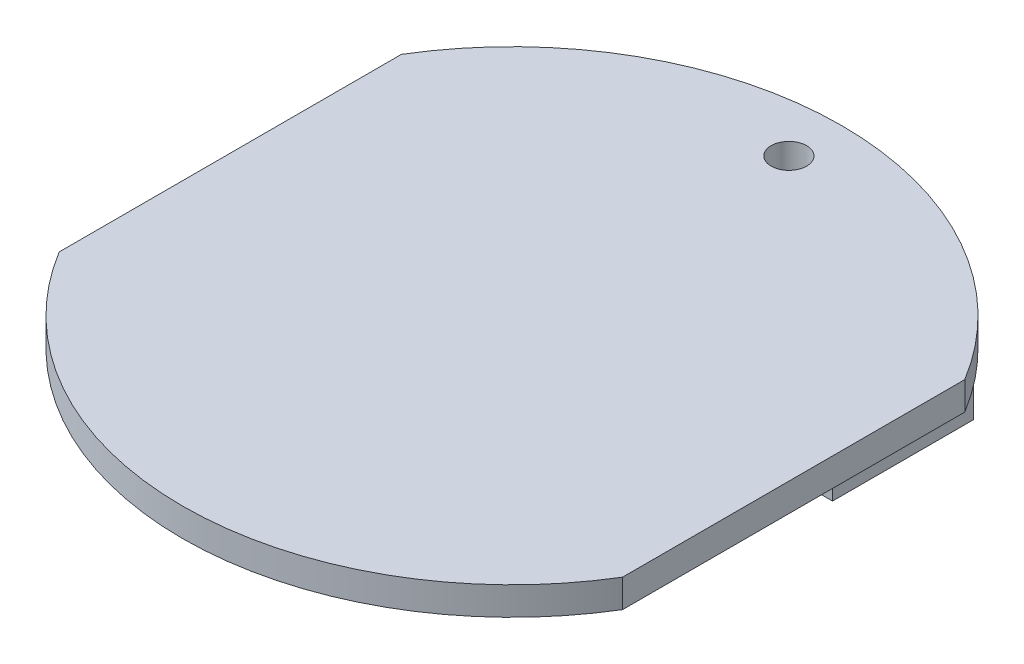
ISO-10303-21;
HEADER;
FILE_DESCRIPTION(('STEP AP214'),'2;1');
FILE_NAME('part.step','',(''),(''),'','','');
FILE_SCHEMA(('AUTOMOTIVE_DESIGN { 1 0 10303 214 1 1 1 1 }'));
ENDSEC;
DATA;
#1=APPLICATION_CONTEXT('core data for automotive mechanical design processes');
#2=APPLICATION_PROTOCOL_DEFINITION('international standard','automotive_design',2000,#1);
#3=PRODUCT_CONTEXT('',#1,'mechanical');
#4=PRODUCT('Part','Part','',(#3));
#5=PRODUCT_RELATED_PRODUCT_CATEGORY('part','',(#4));
#6=PRODUCT_DEFINITION_FORMATION('','',#4);
#7=PRODUCT_DEFINITION_CONTEXT('part definition',#1,'design');
#8=PRODUCT_DEFINITION('design','',#6,#7);
#9=PRODUCT_DEFINITION_SHAPE('','',#8);
#10=(LENGTH_UNIT() NAMED_UNIT(*) SI_UNIT(.MILLI.,.METRE.));
#11=(NAMED_UNIT(*) PLANE_ANGLE_UNIT() SI_UNIT($,.RADIAN.));
#12=(NAMED_UNIT(*) SI_UNIT($,.STERADIAN.) SOLID_ANGLE_UNIT());
#13=UNCERTAINTY_MEASURE_WITH_UNIT(LENGTH_MEASURE(1.E-05),#10,'distance_accuracy_value','');
#14=(GEOMETRIC_REPRESENTATION_CONTEXT(3) GLOBAL_UNCERTAINTY_ASSIGNED_CONTEXT((#13)) GLOBAL_UNIT_ASSIGNED_CONTEXT((#10,
#11,#12)) REPRESENTATION_CONTEXT('',''));
#15=CARTESIAN_POINT('',(0.,0.,0.));
#16=DIRECTION('',(0.,0.,1.));
#17=DIRECTION('',(1.,0.,0.));
#18=AXIS2_PLACEMENT_3D('',#15,#16,#17);
#19=CARTESIAN_POINT('',(0.,11.,0.));
#20=DIRECTION('',(0.,1.,0.));
#21=DIRECTION('',(0.,0.,1.));
#22=AXIS2_PLACEMENT_3D('',#19,#20,#21);
#23=PLANE('',#22);
#24=CARTESIAN_POINT('',(0.,11.,-9.8299778919494));
#25=DIRECTION('',(0.,1.,0.));
#26=DIRECTION('',(0.,0.,1.));
#27=AXIS2_PLACEMENT_3D('',#24,#25,#26);
#28=CIRCLE('',#27,0.630926360981854);
#29=CARTESIAN_POINT('',(0.,11.,-9.19905153096755));
#30=VERTEX_POINT('',#29);
#31=EDGE_CURVE('E47',#30,#30,#28,.F.);
#32=ORIENTED_EDGE('',*,*,#31,.F.);
#33=EDGE_LOOP('',(#32));
#34=FACE_BOUND('',#33,.T.);
#35=DIRECTION('',(0.,0.,1.));
#36=VECTOR('',#35,1.);
#37=CARTESIAN_POINT('',(-10.,11.,-6.07371385562409));
#38=LINE('',#37,#36);
#39=CARTESIAN_POINT('',(-10.,11.,-6.07371385562409));
#40=VERTEX_POINT('',#39);
#41=CARTESIAN_POINT('',(-10.,11.,6.07371385562409));
#42=VERTEX_POINT('',#41);
#43=EDGE_CURVE('E152',#40,#42,#38,.T.);
#44=ORIENTED_EDGE('',*,*,#43,.F.);
#45=CARTESIAN_POINT('',(0.,11.,0.));
#46=DIRECTION('',(0.,1.,0.));
#47=DIRECTION('',(0.,0.,1.));
#48=AXIS2_PLACEMENT_3D('',#45,#46,#47);
#49=CIRCLE('',#48,11.7);
#50=CARTESIAN_POINT('',(10.,11.,-6.07371385562409));
#51=VERTEX_POINT('',#50);
#52=EDGE_CURVE('E168',#51,#40,#49,.T.);
#53=ORIENTED_EDGE('',*,*,#52,.F.);
#54=DIRECTION('',(0.,0.,-1.));
#55=VECTOR('',#54,1.);
#56=CARTESIAN_POINT('',(10.,11.,-6.07371385562409));
#57=LINE('',#56,#55);
#58=CARTESIAN_POINT('',(10.,11.,6.07371385562409));
#59=VERTEX_POINT('',#58);
#60=EDGE_CURVE('E165',#59,#51,#57,.T.);
#61=ORIENTED_EDGE('',*,*,#60,.F.);
#62=CARTESIAN_POINT('',(0.,11.,0.));
#63=DIRECTION('',(0.,1.,0.));
#64=DIRECTION('',(0.,0.,1.));
#65=AXIS2_PLACEMENT_3D('',#62,#63,#64);
#66=CIRCLE('',#65,11.7);
#67=EDGE_CURVE('E146',#42,#59,#66,.T.);
#68=ORIENTED_EDGE('',*,*,#67,.F.);
#69=EDGE_LOOP('',(#44,#53,#61,#68));
#70=FACE_BOUND('',#69,.T.);
#71=DIRECTION('',(0.,0.,1.));
#72=VECTOR('',#71,1.);
#73=CARTESIAN_POINT('',(7.88898672552749,11.,-8.49103256238981));
#74=LINE('',#73,#72);
#75=CARTESIAN_POINT('',(7.88898672552749,11.,-8.49103256238981));
#76=VERTEX_POINT('',#75);
#77=CARTESIAN_POINT('',(7.88898672552749,11.,-3.49103256238982));
#78=VERTEX_POINT('',#77);
#79=EDGE_CURVE('E132',#76,#78,#74,.T.);
#80=ORIENTED_EDGE('',*,*,#79,.F.);
#81=DIRECTION('',(1.,0.,0.));
#82=VECTOR('',#81,1.);
#83=CARTESIAN_POINT('',(7.88898672552749,11.,-8.49103256238981));
#84=LINE('',#83,#82);
#85=CARTESIAN_POINT('',(3.99745758528964,11.,-8.49103256238981));
#86=VERTEX_POINT('',#85);
#87=EDGE_CURVE('E129',#86,#76,#84,.T.);
#88=ORIENTED_EDGE('',*,*,#87,.F.);
#89=DIRECTION('',(0.,0.,-1.));
#90=VECTOR('',#89,1.);
#91=CARTESIAN_POINT('',(3.99745758528964,11.,-8.49103256238981));
#92=LINE('',#91,#90);
#93=CARTESIAN_POINT('',(3.99745758528964,11.,-3.49103256238982));
#94=VERTEX_POINT('',#93);
#95=EDGE_CURVE('E65',#94,#86,#92,.T.);
#96=ORIENTED_EDGE('',*,*,#95,.F.);
#97=DIRECTION('',(-1.,0.,0.));
#98=VECTOR('',#97,1.);
#99=CARTESIAN_POINT('',(7.88898672552749,11.,-3.49103256238982));
#100=LINE('',#99,#98);
#101=EDGE_CURVE('E60',#78,#94,#100,.T.);
#102=ORIENTED_EDGE('',*,*,#101,.F.);
#103=EDGE_LOOP('',(#80,#88,#96,#102));
#104=FACE_BOUND('',#103,.T.);
#105=ADVANCED_FACE('F43',(#34,#70,#104),#23,.F.);
#106=CARTESIAN_POINT('',(0.,12.,0.));
#107=DIRECTION('',(0.,1.,0.));
#108=DIRECTION('',(0.,0.,1.));
#109=AXIS2_PLACEMENT_3D('',#106,#107,#108);
#110=PLANE('',#109);
#111=CARTESIAN_POINT('',(0.,12.,0.));
#112=DIRECTION('',(0.,1.,0.));
#113=DIRECTION('',(0.,0.,1.));
#114=AXIS2_PLACEMENT_3D('',#111,#112,#113);
#115=CIRCLE('',#114,11.7);
#116=CARTESIAN_POINT('',(-10.,12.,6.07371385562409));
#117=VERTEX_POINT('',#116);
#118=CARTESIAN_POINT('',(10.,12.,6.07371385562409));
#119=VERTEX_POINT('',#118);
#120=EDGE_CURVE('E147',#117,#119,#115,.T.);
#121=ORIENTED_EDGE('',*,*,#120,.T.);
#122=DIRECTION('',(0.,0.,-1.));
#123=VECTOR('',#122,1.);
#124=CARTESIAN_POINT('',(10.,12.,-6.07371385562409));
#125=LINE('',#124,#123);
#126=CARTESIAN_POINT('',(10.,12.,-6.07371385562409));
#127=VERTEX_POINT('',#126);
#128=EDGE_CURVE('E151',#119,#127,#125,.T.);
#129=ORIENTED_EDGE('',*,*,#128,.T.);
#130=CARTESIAN_POINT('',(0.,12.,0.));
#131=DIRECTION('',(0.,1.,0.));
#132=DIRECTION('',(0.,0.,1.));
#133=AXIS2_PLACEMENT_3D('',#130,#131,#132);
#134=CIRCLE('',#133,11.7);
#135=CARTESIAN_POINT('',(-10.,12.,-6.07371385562409));
#136=VERTEX_POINT('',#135);
#137=EDGE_CURVE('E155',#127,#136,#134,.T.);
#138=ORIENTED_EDGE('',*,*,#137,.T.);
#139=DIRECTION('',(0.,0.,1.));
#140=VECTOR('',#139,1.);
#141=CARTESIAN_POINT('',(-10.,12.,-6.07371385562409));
#142=LINE('',#141,#140);
#143=EDGE_CURVE('E158',#136,#117,#142,.T.);
#144=ORIENTED_EDGE('',*,*,#143,.T.);
#145=EDGE_LOOP('',(#121,#129,#138,#144));
#146=FACE_BOUND('',#145,.T.);
#147=CARTESIAN_POINT('',(0.,12.,-9.8299778919494));
#148=DIRECTION('',(0.,1.,0.));
#149=DIRECTION('',(0.,0.,1.));
#150=AXIS2_PLACEMENT_3D('',#147,#148,#149);
#151=CIRCLE('',#150,0.630926360981854);
#152=CARTESIAN_POINT('',(0.,12.,-9.19905153096755));
#153=VERTEX_POINT('',#152);
#154=EDGE_CURVE('E138',#153,#153,#151,.T.);
#155=ORIENTED_EDGE('',*,*,#154,.F.);
#156=EDGE_LOOP('',(#155));
#157=FACE_BOUND('',#156,.T.);
#158=ADVANCED_FACE('F198',(#146,#157),#110,.T.);
#159=CARTESIAN_POINT('',(0.,12.,0.));
#160=DIRECTION('',(0.,-1.,0.));
#161=DIRECTION('',(0.,0.,-1.));
#162=AXIS2_PLACEMENT_3D('',#159,#160,#161);
#163=CYLINDRICAL_SURFACE('',#162,11.7);
#164=ORIENTED_EDGE('',*,*,#67,.T.);
#165=DIRECTION('',(0.,-1.,0.));
#166=VECTOR('',#165,1.);
#167=CARTESIAN_POINT('',(10.,12.,6.07371385562409));
#168=LINE('',#167,#166);
#169=EDGE_CURVE('E12',#119,#59,#168,.T.);
#170=ORIENTED_EDGE('',*,*,#169,.F.);
#171=ORIENTED_EDGE('',*,*,#120,.F.);
#172=DIRECTION('',(0.,-1.,0.));
#173=VECTOR('',#172,1.);
#174=CARTESIAN_POINT('',(-10.,12.,6.07371385562409));
#175=LINE('',#174,#173);
#176=EDGE_CURVE('E161',#117,#42,#175,.T.);
#177=ORIENTED_EDGE('',*,*,#176,.T.);
#178=EDGE_LOOP('',(#164,#170,#171,#177));
#179=FACE_BOUND('',#178,.T.);
#180=ADVANCED_FACE('F45',(#179),#163,.T.);
#181=CARTESIAN_POINT('',(10.,12.,-6.07371385562409));
#182=DIRECTION('',(-1.,0.,0.));
#183=DIRECTION('',(0.,0.,1.));
#184=AXIS2_PLACEMENT_3D('',#181,#182,#183);
#185=PLANE('',#184);
#186=ORIENTED_EDGE('',*,*,#60,.T.);
#187=DIRECTION('',(0.,-1.,0.));
#188=VECTOR('',#187,1.);
#189=CARTESIAN_POINT('',(10.,12.,-6.07371385562409));
#190=LINE('',#189,#188);
#191=EDGE_CURVE('E53',#127,#51,#190,.T.);
#192=ORIENTED_EDGE('',*,*,#191,.F.);
#193=ORIENTED_EDGE('',*,*,#128,.F.);
#194=ORIENTED_EDGE('',*,*,#169,.T.);
#195=EDGE_LOOP('',(#186,#192,#193,#194));
#196=FACE_BOUND('',#195,.T.);
#197=ADVANCED_FACE('F201',(#196),#185,.F.);
#198=CARTESIAN_POINT('',(0.,12.,0.));
#199=DIRECTION('',(0.,-1.,0.));
#200=DIRECTION('',(0.,0.,-1.));
#201=AXIS2_PLACEMENT_3D('',#198,#199,#200);
#202=CYLINDRICAL_SURFACE('',#201,11.7);
#203=ORIENTED_EDGE('',*,*,#52,.T.);
#204=DIRECTION('',(0.,-1.,0.));
#205=VECTOR('',#204,1.);
#206=CARTESIAN_POINT('',(-10.,12.,-6.07371385562409));
#207=LINE('',#206,#205);
#208=EDGE_CURVE('E176',#136,#40,#207,.T.);
#209=ORIENTED_EDGE('',*,*,#208,.F.);
#210=ORIENTED_EDGE('',*,*,#137,.F.);
#211=ORIENTED_EDGE('',*,*,#191,.T.);
#212=EDGE_LOOP('',(#203,#209,#210,#211));
#213=FACE_BOUND('',#212,.T.);
#214=ADVANCED_FACE('F186',(#213),#202,.T.);
#215=CARTESIAN_POINT('',(-10.,12.,-6.07371385562409));
#216=DIRECTION('',(1.,0.,0.));
#217=DIRECTION('',(0.,0.,-1.));
#218=AXIS2_PLACEMENT_3D('',#215,#216,#217);
#219=PLANE('',#218);
#220=ORIENTED_EDGE('',*,*,#43,.T.);
#221=ORIENTED_EDGE('',*,*,#176,.F.);
#222=ORIENTED_EDGE('',*,*,#143,.F.);
#223=ORIENTED_EDGE('',*,*,#208,.T.);
#224=EDGE_LOOP('',(#220,#221,#222,#223));
#225=FACE_BOUND('',#224,.T.);
#226=ADVANCED_FACE('F195',(#225),#219,.F.);
#227=CARTESIAN_POINT('',(0.,12.,-9.8299778919494));
#228=DIRECTION('',(0.,-1.,0.));
#229=DIRECTION('',(0.,0.,-1.));
#230=AXIS2_PLACEMENT_3D('',#227,#228,#229);
#231=CYLINDRICAL_SURFACE('',#230,0.630926360981854);
#232=ORIENTED_EDGE('',*,*,#154,.T.);
#233=EDGE_LOOP('',(#232));
#234=FACE_BOUND('',#233,.T.);
#235=ORIENTED_EDGE('',*,*,#31,.T.);
#236=EDGE_LOOP('',(#235));
#237=FACE_BOUND('',#236,.T.);
#238=ADVANCED_FACE('F219',(#234,#237),#231,.F.);
#239=CARTESIAN_POINT('',(7.88898672552749,8.5,-8.49103256238981));
#240=DIRECTION('',(-1.,0.,0.));
#241=DIRECTION('',(0.,0.,1.));
#242=AXIS2_PLACEMENT_3D('',#239,#240,#241);
#243=PLANE('',#242);
#244=ORIENTED_EDGE('',*,*,#79,.T.);
#245=DIRECTION('',(0.,1.,0.));
#246=VECTOR('',#245,1.);
#247=CARTESIAN_POINT('',(7.88898672552749,8.5,-3.49103256238982));
#248=LINE('',#247,#246);
#249=CARTESIAN_POINT('',(7.88898672552749,8.5,-3.49103256238982));
#250=VERTEX_POINT('',#249);
#251=EDGE_CURVE('E111',#250,#78,#248,.T.);
#252=ORIENTED_EDGE('',*,*,#251,.F.);
#253=DIRECTION('',(0.,0.,1.));
#254=VECTOR('',#253,1.);
#255=CARTESIAN_POINT('',(7.88898672552749,8.5,-8.49103256238981));
#256=LINE('',#255,#254);
#257=CARTESIAN_POINT('',(7.88898672552749,8.5,-8.49103256238981));
#258=VERTEX_POINT('',#257);
#259=EDGE_CURVE('E119',#258,#250,#256,.T.);
#260=ORIENTED_EDGE('',*,*,#259,.F.);
#261=DIRECTION('',(0.,1.,0.));
#262=VECTOR('',#261,1.);
#263=CARTESIAN_POINT('',(7.88898672552749,8.5,-8.49103256238981));
#264=LINE('',#263,#262);
#265=EDGE_CURVE('E310',#258,#76,#264,.T.);
#266=ORIENTED_EDGE('',*,*,#265,.T.);
#267=EDGE_LOOP('',(#244,#252,#260,#266));
#268=FACE_BOUND('',#267,.T.);
#269=ADVANCED_FACE('F131',(#268),#243,.F.);
#270=CARTESIAN_POINT('',(7.88898672552749,8.5,-3.49103256238982));
#271=DIRECTION('',(0.,0.,-1.));
#272=DIRECTION('',(-1.,0.,0.));
#273=AXIS2_PLACEMENT_3D('',#270,#271,#272);
#274=PLANE('',#273);
#275=ORIENTED_EDGE('',*,*,#101,.T.);
#276=DIRECTION('',(0.,1.,0.));
#277=VECTOR('',#276,1.);
#278=CARTESIAN_POINT('',(3.99745758528964,8.5,-3.49103256238982));
#279=LINE('',#278,#277);
#280=CARTESIAN_POINT('',(3.99745758528964,8.5,-3.49103256238982));
#281=VERTEX_POINT('',#280);
#282=EDGE_CURVE('E114',#281,#94,#279,.T.);
#283=ORIENTED_EDGE('',*,*,#282,.F.);
#284=DIRECTION('',(-1.,0.,0.));
#285=VECTOR('',#284,1.);
#286=CARTESIAN_POINT('',(7.88898672552749,8.5,-3.49103256238982));
#287=LINE('',#286,#285);
#288=EDGE_CURVE('E107',#250,#281,#287,.T.);
#289=ORIENTED_EDGE('',*,*,#288,.F.);
#290=ORIENTED_EDGE('',*,*,#251,.T.);
#291=EDGE_LOOP('',(#275,#283,#289,#290));
#292=FACE_BOUND('',#291,.T.);
#293=ADVANCED_FACE('F109',(#292),#274,.F.);
#294=CARTESIAN_POINT('',(3.99745758528964,8.5,-8.49103256238981));
#295=DIRECTION('',(1.,0.,0.));
#296=DIRECTION('',(0.,0.,-1.));
#297=AXIS2_PLACEMENT_3D('',#294,#295,#296);
#298=PLANE('',#297);
#299=ORIENTED_EDGE('',*,*,#95,.T.);
#300=DIRECTION('',(0.,1.,0.));
#301=VECTOR('',#300,1.);
#302=CARTESIAN_POINT('',(3.99745758528964,8.5,-8.49103256238981));
#303=LINE('',#302,#301);
#304=CARTESIAN_POINT('',(3.99745758528964,8.5,-8.49103256238981));
#305=VERTEX_POINT('',#304);
#306=EDGE_CURVE('E139',#305,#86,#303,.T.);
#307=ORIENTED_EDGE('',*,*,#306,.F.);
#308=DIRECTION('',(0.,0.,-1.));
#309=VECTOR('',#308,1.);
#310=CARTESIAN_POINT('',(3.99745758528964,8.5,-8.49103256238981));
#311=LINE('',#310,#309);
#312=EDGE_CURVE('E118',#281,#305,#311,.T.);
#313=ORIENTED_EDGE('',*,*,#312,.F.);
#314=ORIENTED_EDGE('',*,*,#282,.T.);
#315=EDGE_LOOP('',(#299,#307,#313,#314));
#316=FACE_BOUND('',#315,.T.);
#317=ADVANCED_FACE('F248',(#316),#298,.F.);
#318=CARTESIAN_POINT('',(7.88898672552749,8.5,-8.49103256238981));
#319=DIRECTION('',(0.,0.,1.));
#320=DIRECTION('',(1.,0.,0.));
#321=AXIS2_PLACEMENT_3D('',#318,#319,#320);
#322=PLANE('',#321);
#323=ORIENTED_EDGE('',*,*,#87,.T.);
#324=ORIENTED_EDGE('',*,*,#265,.F.);
#325=DIRECTION('',(1.,0.,0.));
#326=VECTOR('',#325,1.);
#327=CARTESIAN_POINT('',(7.88898672552749,8.5,-8.49103256238981));
#328=LINE('',#327,#326);
#329=EDGE_CURVE('E124',#305,#258,#328,.T.);
#330=ORIENTED_EDGE('',*,*,#329,.F.);
#331=ORIENTED_EDGE('',*,*,#306,.T.);
#332=EDGE_LOOP('',(#323,#324,#330,#331));
#333=FACE_BOUND('',#332,.T.);
#334=ADVANCED_FACE('F255',(#333),#322,.F.);
#335=CARTESIAN_POINT('',(0.,8.5,0.));
#336=DIRECTION('',(0.,-1.,0.));
#337=DIRECTION('',(0.,0.,-1.));
#338=AXIS2_PLACEMENT_3D('',#335,#336,#337);
#339=PLANE('',#338);
#340=ORIENTED_EDGE('',*,*,#259,.T.);
#341=ORIENTED_EDGE('',*,*,#288,.T.);
#342=ORIENTED_EDGE('',*,*,#312,.T.);
#343=ORIENTED_EDGE('',*,*,#329,.T.);
#344=EDGE_LOOP('',(#340,#341,#342,#343));
#345=FACE_BOUND('',#344,.T.);
#346=ADVANCED_FACE('F122',(#345),#339,.T.);
#347=CLOSED_SHELL('',(#105,#158,#180,#197,#214,#226,#238,#269,#293,#317,#334,#346));
#348=MANIFOLD_SOLID_BREP('B2',#347);
#349=ADVANCED_BREP_SHAPE_REPRESENTATION('',(#18,#348),#14);
#350=SHAPE_DEFINITION_REPRESENTATION(#9,#349);
ENDSEC;
END-ISO-10303-21;
